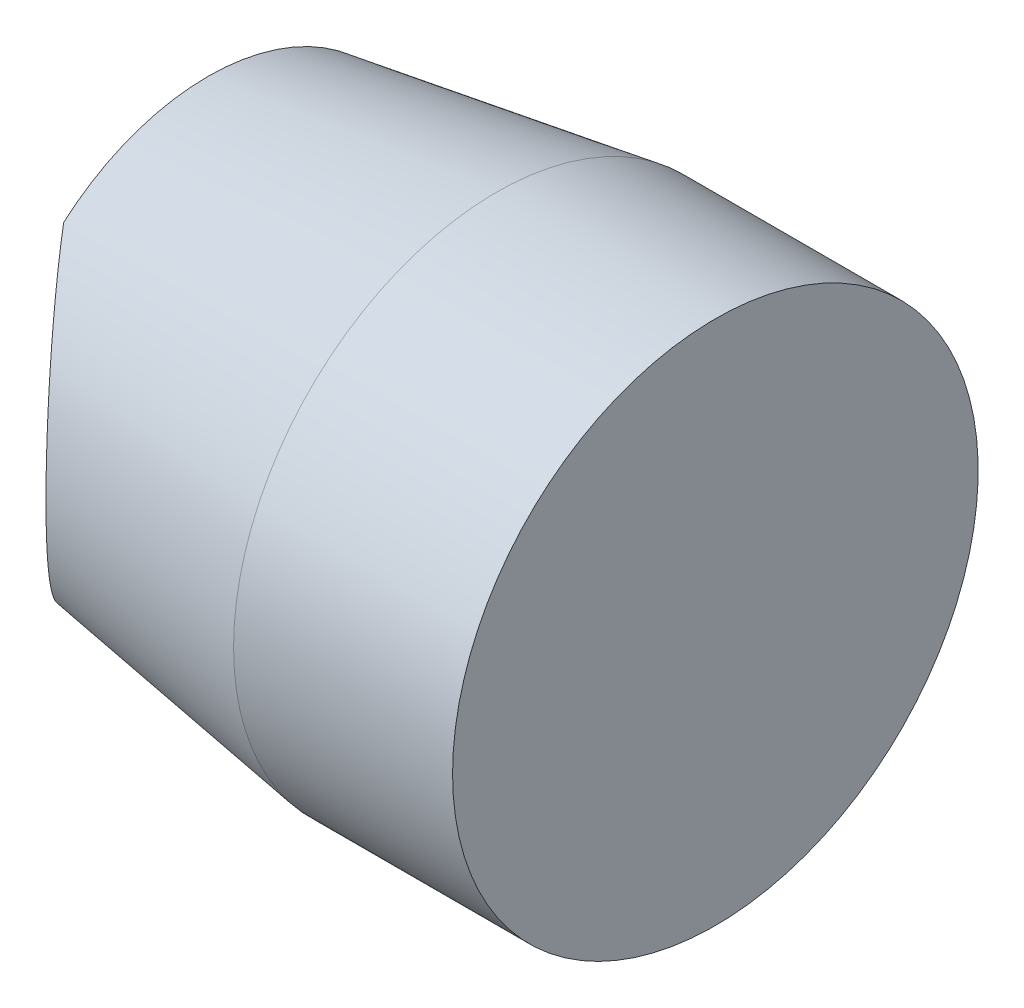
ISO-10303-21;
HEADER;
FILE_DESCRIPTION(('STEP AP214'),'2;1');
FILE_NAME('part.step','',(''),(''),'','','');
FILE_SCHEMA(('AUTOMOTIVE_DESIGN { 1 0 10303 214 1 1 1 1 }'));
ENDSEC;
DATA;
#1=APPLICATION_CONTEXT('core data for automotive mechanical design processes');
#2=APPLICATION_PROTOCOL_DEFINITION('international standard','automotive_design',2000,#1);
#3=PRODUCT_CONTEXT('',#1,'mechanical');
#4=PRODUCT('Part','Part','',(#3));
#5=PRODUCT_RELATED_PRODUCT_CATEGORY('part','',(#4));
#6=PRODUCT_DEFINITION_FORMATION('','',#4);
#7=PRODUCT_DEFINITION_CONTEXT('part definition',#1,'design');
#8=PRODUCT_DEFINITION('design','',#6,#7);
#9=PRODUCT_DEFINITION_SHAPE('','',#8);
#10=(LENGTH_UNIT() NAMED_UNIT(*) SI_UNIT(.MILLI.,.METRE.));
#11=(NAMED_UNIT(*) PLANE_ANGLE_UNIT() SI_UNIT($,.RADIAN.));
#12=(NAMED_UNIT(*) SI_UNIT($,.STERADIAN.) SOLID_ANGLE_UNIT());
#13=UNCERTAINTY_MEASURE_WITH_UNIT(LENGTH_MEASURE(1.E-05),#10,'distance_accuracy_value','');
#14=(GEOMETRIC_REPRESENTATION_CONTEXT(3) GLOBAL_UNCERTAINTY_ASSIGNED_CONTEXT((#13)) GLOBAL_UNIT_ASSIGNED_CONTEXT((#10,
#11,#12)) REPRESENTATION_CONTEXT('',''));
#15=CARTESIAN_POINT('',(0.,0.,0.));
#16=DIRECTION('',(0.,0.,1.));
#17=DIRECTION('',(1.,0.,0.));
#18=AXIS2_PLACEMENT_3D('',#15,#16,#17);
#19=CARTESIAN_POINT('',(0.,3.,0.));
#20=DIRECTION('',(1.,0.,0.));
#21=DIRECTION('',(0.,0.,-1.));
#22=AXIS2_PLACEMENT_3D('',#19,#20,#21);
#23=PLANE('',#22);
#24=CARTESIAN_POINT('',(0.,2.30271578793389,0.));
#25=CARTESIAN_POINT('',(0.,2.30271619018956,-0.256057420989866));
#26=CARTESIAN_POINT('',(0.,2.30041481848519,-0.512115486956815));
#27=CARTESIAN_POINT('',(0.,2.29111924963619,-1.02415480128034));
#28=CARTESIAN_POINT('',(0.,2.28412491334884,-1.28013604713413));
#29=CARTESIAN_POINT('',(0.,2.26515634263327,-1.79209873847997));
#30=CARTESIAN_POINT('',(0.,2.253178571374,-2.04808005473503));
#31=CARTESIAN_POINT('',(0.,2.22375143060397,-2.5597230435989));
#32=CARTESIAN_POINT('',(0.,2.20630226342632,-2.81538472767682));
#33=CARTESIAN_POINT('',(0.,2.16524643190168,-3.32543629194042));
#34=CARTESIAN_POINT('',(0.,2.14165868193388,-3.57982767413026));
#35=CARTESIAN_POINT('',(0.,2.08723238381336,-4.08783054496586));
#36=CARTESIAN_POINT('',(0.,2.05639433168584,-4.34144208576206));
#37=CARTESIAN_POINT('',(0.,1.98596835851503,-4.84715786518813));
#38=CARTESIAN_POINT('',(0.,1.94639075878595,-5.09926352451207));
#39=CARTESIAN_POINT('',(0.,1.85625347124165,-5.60147587977535));
#40=CARTESIAN_POINT('',(0.,1.80569793894974,-5.85158329507749));
#41=CARTESIAN_POINT('',(0.,1.7268048879287,-6.19068734125625));
#42=CARTESIAN_POINT('',(0.,1.70474160874452,-6.28114936187864));
#43=CARTESIAN_POINT('',(0.,1.65842518892863,-6.46151329243922));
#44=CARTESIAN_POINT('',(0.,1.63417190698073,-6.55141516583159));
#45=CARTESIAN_POINT('',(0.,1.55761053823987,-6.82052527713747));
#46=CARTESIAN_POINT('',(0.,1.50159393528638,-6.99872681524354));
#47=CARTESIAN_POINT('',(0.,1.4057193897648,-7.26818101742081));
#48=CARTESIAN_POINT('',(0.,1.37056144158468,-7.36111016036302));
#49=CARTESIAN_POINT('',(0.,1.29578812835875,-7.54514746566464));
#50=CARTESIAN_POINT('',(0.,1.25617413392555,-7.63625617786238));
#51=CARTESIAN_POINT('',(0.,1.17166272957867,-7.81562118473223));
#52=CARTESIAN_POINT('',(0.,1.12678436031493,-7.90388637202995));
#53=CARTESIAN_POINT('',(0.,1.03033462518166,-8.07664019329982));
#54=CARTESIAN_POINT('',(0.,0.978771037054321,-8.16113306485225));
#55=CARTESIAN_POINT('',(0.,0.885941912754167,-8.29664915808889));
#56=CARTESIAN_POINT('',(0.,0.84709792125466,-8.34932127970212));
#57=CARTESIAN_POINT('',(0.,0.764833982254394,-8.45113444955086));
#58=CARTESIAN_POINT('',(0.,0.721408353970244,-8.50027098403376));
#59=CARTESIAN_POINT('',(0.,0.628750007651179,-8.59375005583249));
#60=CARTESIAN_POINT('',(0.,0.57946639964579,-8.63804302692048));
#61=CARTESIAN_POINT('',(0.,0.474646326766768,-8.71854835575752));
#62=CARTESIAN_POINT('',(0.,0.419126230673049,-8.75478115605383));
#63=CARTESIAN_POINT('',(0.,0.321574321522042,-8.80503790469086));
#64=CARTESIAN_POINT('',(0.,0.281295684209852,-8.82243192409152));
#65=CARTESIAN_POINT('',(0.,0.198469720279116,-8.85055246719884));
#66=CARTESIAN_POINT('',(0.,0.155925377250438,-8.86128753498317));
#67=CARTESIAN_POINT('',(0.,0.0692672934627121,-8.8750354301983));
#68=CARTESIAN_POINT('',(0.,0.025144684355504,-8.87799394040268));
#69=CARTESIAN_POINT('',(0.,-0.0628867030327287,-8.8756600309061));
#70=CARTESIAN_POINT('',(0.,-0.106795434737063,-8.8703658880979));
#71=CARTESIAN_POINT('',(0.,-0.189453872023171,-8.85291423995703));
#72=CARTESIAN_POINT('',(0.,-0.228333011571382,-8.84134882624701));
#73=CARTESIAN_POINT('',(0.,-0.304013576985636,-8.81278219020494));
#74=CARTESIAN_POINT('',(0.,-0.340814064186539,-8.79577853483315));
#75=CARTESIAN_POINT('',(0.,-0.435724052160858,-8.74463976172805));
#76=CARTESIAN_POINT('',(0.,-0.49173488368535,-8.70663068469886));
#77=CARTESIAN_POINT('',(0.,-0.597384420222757,-8.62258351253169));
#78=CARTESIAN_POINT('',(0.,-0.647000923525924,-8.57651868587694));
#79=CARTESIAN_POINT('',(0.,-0.738420787686659,-8.48141943838558));
#80=CARTESIAN_POINT('',(0.,-0.780483190798535,-8.43262968793735));
#81=CARTESIAN_POINT('',(0.,-0.860363663787594,-8.33166006153359));
#82=CARTESIAN_POINT('',(0.,-0.898177557763886,-8.27947692834547));
#83=CARTESIAN_POINT('',(0.,-0.970265298966888,-8.1726008019032));
#84=CARTESIAN_POINT('',(0.,-1.00453235369548,-8.11790327231091));
#85=CARTESIAN_POINT('',(0.,-1.06997588681387,-8.0067365508432));
#86=CARTESIAN_POINT('',(0.,-1.1011536514987,-7.9502681093297));
#87=CARTESIAN_POINT('',(0.,-1.17871942577881,-7.80183009848809));
#88=CARTESIAN_POINT('',(0.,-1.22307166246294,-7.70879838397381));
#89=CARTESIAN_POINT('',(0.,-1.30642615604186,-7.52034871378631));
#90=CARTESIAN_POINT('',(0.,-1.3454254822028,-7.42492948447364));
#91=CARTESIAN_POINT('',(0.,-1.41906850582677,-7.23223917262614));
#92=CARTESIAN_POINT('',(0.,-1.45370425192824,-7.13496507099022));
#93=CARTESIAN_POINT('',(0.,-1.51924640991826,-6.93916248548734));
#94=CARTESIAN_POINT('',(0.,-1.55015216135109,-6.84063378287749));
#95=CARTESIAN_POINT('',(0.,-1.63845867239388,-6.54247188284159));
#96=CARTESIAN_POINT('',(0.,-1.69103038798245,-6.341401393893));
#97=CARTESIAN_POINT('',(0.,-1.76252778911013,-6.03826032449602));
#98=CARTESIAN_POINT('',(0.,-1.78512288550943,-5.93701496005578));
#99=CARTESIAN_POINT('',(0.,-1.82813198605774,-5.73406043139156));
#100=CARTESIAN_POINT('',(0.,-1.84854603196845,-5.63235127608693));
#101=CARTESIAN_POINT('',(0.,-1.9068058463016,-5.32703299721612));
#102=CARTESIAN_POINT('',(0.,-1.94175302379137,-5.12286990941627));
#103=CARTESIAN_POINT('',(0.,-2.00530126064684,-4.71354875654689));
#104=CARTESIAN_POINT('',(0.,-2.03390144215257,-4.50839055784738));
#105=CARTESIAN_POINT('',(0.,-2.08575961890146,-4.09729416459807));
#106=CARTESIAN_POINT('',(0.,-2.1090147538267,-3.89135561209155));
#107=CARTESIAN_POINT('',(0.,-2.15089621228305,-3.47902015363704));
#108=CARTESIAN_POINT('',(0.,-2.16952264070898,-3.27262325818288));
#109=CARTESIAN_POINT('',(0.,-2.21940195439557,-2.65200420600774));
#110=CARTESIAN_POINT('',(0.,-2.24454294069056,-2.23728632251772));
#111=CARTESIAN_POINT('',(0.,-2.28142740306044,-1.40725400885803));
#112=CARTESIAN_POINT('',(0.,-2.29316981067247,-0.991939533757277));
#113=CARTESIAN_POINT('',(0.,-2.3016197372805,-0.369267348183715));
#114=CARTESIAN_POINT('',(0.,-2.30291230270835,-0.16196276239538));
#115=CARTESIAN_POINT('',(0.,-2.3024710305298,0.252629882313115));
#116=CARTESIAN_POINT('',(0.,-2.30073738720339,0.459917941439896));
#117=CARTESIAN_POINT('',(0.,-2.29095752287499,1.08179520044146));
#118=CARTESIAN_POINT('',(0.,-2.27833132736208,1.49632166318861));
#119=CARTESIAN_POINT('',(0.,-2.23960090872179,2.32445014572915));
#120=CARTESIAN_POINT('',(0.,-2.21350733620163,2.73805263702833));
#121=CARTESIAN_POINT('',(0.,-2.16202951844811,3.35737616867643));
#122=CARTESIAN_POINT('',(0.,-2.14281682382819,3.56361444597708));
#123=CARTESIAN_POINT('',(0.,-2.09968033832001,3.97559397609276));
#124=CARTESIAN_POINT('',(0.,-2.07575679467123,4.1813352544184));
#125=CARTESIAN_POINT('',(0.,-2.02276922950357,4.58954739533259));
#126=CARTESIAN_POINT('',(0.,-1.99377317972838,4.79202699831362));
#127=CARTESIAN_POINT('',(0.,-1.92943633981791,5.19602664483702));
#128=CARTESIAN_POINT('',(0.,-1.89409445611595,5.39754651683657));
#129=CARTESIAN_POINT('',(0.,-1.81574891109572,5.79876514286587));
#130=CARTESIAN_POINT('',(0.,-1.77275781204449,5.99846632685503));
#131=CARTESIAN_POINT('',(0.,-1.67713009184717,6.39551924105181));
#132=CARTESIAN_POINT('',(0.,-1.62449797852452,6.59287202355924));
#133=CARTESIAN_POINT('',(0.,-1.54492452873739,6.85656335344364));
#134=CARTESIAN_POINT('',(0.,-1.52355197367489,6.92458932954281));
#135=CARTESIAN_POINT('',(0.,-1.47906175081979,7.06007099641875));
#136=CARTESIAN_POINT('',(0.,-1.45594394655084,7.12752664213677));
#137=CARTESIAN_POINT('',(0.,-1.38353872556474,7.32925136467965));
#138=CARTESIAN_POINT('',(0.,-1.33130965598138,7.46250472075917));
#139=CARTESIAN_POINT('',(0.,-1.24198272845094,7.66674464493482));
#140=CARTESIAN_POINT('',(0.,-1.20837736216438,7.73926169412236));
#141=CARTESIAN_POINT('',(0.,-1.13740084310569,7.88241962709404));
#142=CARTESIAN_POINT('',(0.,-1.10003098285226,7.95306114437709));
#143=CARTESIAN_POINT('',(0.,-1.02090992465701,8.09151760217561));
#144=CARTESIAN_POINT('',(0.,-0.979175730560581,8.15934217275296));
#145=CARTESIAN_POINT('',(0.,-0.890251463452173,8.29127566708565));
#146=CARTESIAN_POINT('',(0.,-0.843068018245905,8.35538896515575));
#147=CARTESIAN_POINT('',(0.,-0.755045799269324,8.46215935104652));
#148=CARTESIAN_POINT('',(0.,-0.715737177571885,8.50606740884148));
#149=CARTESIAN_POINT('',(0.,-0.632704545578179,8.58968335996891));
#150=CARTESIAN_POINT('',(0.,-0.588974950121212,8.62938580728426));
#151=CARTESIAN_POINT('',(0.,-0.495998697363988,8.70312099761332));
#152=CARTESIAN_POINT('',(0.,-0.446691541306113,8.73707910899359));
#153=CARTESIAN_POINT('',(0.,-0.342876817664349,8.79581530258852));
#154=CARTESIAN_POINT('',(0.,-0.288386761369271,8.82062300584898));
#155=CARTESIAN_POINT('',(0.,-0.192503788108303,8.85208446454662));
#156=CARTESIAN_POINT('',(0.,-0.152176340718685,8.86196610505212));
#157=CARTESIAN_POINT('',(0.,-0.0704317051299258,8.87476414709608));
#158=CARTESIAN_POINT('',(0.,-0.0290155178170578,8.87768673432845));
#159=CARTESIAN_POINT('',(0.,0.0537229626135532,8.87625323091297));
#160=CARTESIAN_POINT('',(0.,0.0950451431318834,8.87189082477117));
#161=CARTESIAN_POINT('',(0.,0.17638670554275,8.85634801479037));
#162=CARTESIAN_POINT('',(0.,0.216404816540665,8.84516115779466));
#163=CARTESIAN_POINT('',(0.,0.30689333045181,8.81241333859658));
#164=CARTESIAN_POINT('',(0.,0.356565965688615,8.78866889766332));
#165=CARTESIAN_POINT('',(0.,0.451507184584574,8.73362017494527));
#166=CARTESIAN_POINT('',(0.,0.496765469772759,8.70229878174129));
#167=CARTESIAN_POINT('',(0.,0.612713048969769,8.61090392671316));
#168=CARTESIAN_POINT('',(0.,0.679454832489103,8.54588313607115));
#169=CARTESIAN_POINT('',(0.,0.803085416460741,8.40717256810155));
#170=CARTESIAN_POINT('',(0.,0.859945900699665,8.33345886126733));
#171=CARTESIAN_POINT('',(0.,0.98631503516413,8.15146856801582));
#172=CARTESIAN_POINT('',(0.,1.0523081650411,8.04078083721444));
#173=CARTESIAN_POINT('',(0.,1.17368742348289,7.81365213824607));
#174=CARTESIAN_POINT('',(0.,1.22905109381456,7.69719962865867));
#175=CARTESIAN_POINT('',(0.,1.33189585938514,7.46015331640255));
#176=CARTESIAN_POINT('',(0.,1.37933253052256,7.3395404637223));
#177=CARTESIAN_POINT('',(0.,1.46764168179653,7.09611113719619));
#178=CARTESIAN_POINT('',(0.,1.50852068731415,6.97329699084475));
#179=CARTESIAN_POINT('',(0.,1.61487822130925,6.62957748985516));
#180=CARTESIAN_POINT('',(0.,1.67465938159899,6.40691503845951));
#181=CARTESIAN_POINT('',(0.,1.78206037868896,5.95863520057769));
#182=CARTESIAN_POINT('',(0.,1.82967262547771,5.73301606171055));
#183=CARTESIAN_POINT('',(0.,1.9154973103287,5.27952684179919));
#184=CARTESIAN_POINT('',(0.,1.95368975838205,5.0516530232704));
#185=CARTESIAN_POINT('',(0.,2.02240235756378,4.59474688328533));
#186=CARTESIAN_POINT('',(0.,2.05292167010774,4.3657144379925));
#187=CARTESIAN_POINT('',(0.,2.10755735583778,3.90705654637218));
#188=CARTESIAN_POINT('',(0.,2.13167812178194,3.67743161672352));
#189=CARTESIAN_POINT('',(0.,2.17447442712944,3.21766783595543));
#190=CARTESIAN_POINT('',(0.,2.19314964706602,2.98752895548248));
#191=CARTESIAN_POINT('',(0.,2.22570457347171,2.52718464100216));
#192=CARTESIAN_POINT('',(0.,2.23958982124239,2.29697959433125));
#193=CARTESIAN_POINT('',(0.,2.26306850731441,1.83635170891861));
#194=CARTESIAN_POINT('',(0.,2.27266191776965,1.60592886877352));
#195=CARTESIAN_POINT('',(0.,2.28782899789987,1.14629951757147));
#196=CARTESIAN_POINT('',(0.,2.29342581672636,0.917093762259857));
#197=CARTESIAN_POINT('',(0.,2.30086927779234,0.458592182283086));
#198=CARTESIAN_POINT('',(0.,2.30271542771876,0.229296349744708));
#199=CARTESIAN_POINT('',(0.,2.30271578793389,0.));
#200=B_SPLINE_CURVE_WITH_KNOTS('',3,(#24,#25,#26,#27,#28,#29,#30,#31,#32,#33,#34,#35,#36,#37,
#38,#39,#40,#41,#42,#43,#44,#45,#46,#47,#48,#49,#50,#51,#52,#53,#54,#55,#56,#57,#58,#59,#60,#61,
#62,#63,#64,#65,#66,#67,#68,#69,#70,#71,#72,#73,#74,#75,#76,#77,#78,#79,#80,#81,#82,#83,#84,#85,
#86,#87,#88,#89,#90,#91,#92,#93,#94,#95,#96,#97,#98,#99,#100,#101,#102,#103,#104,#105,#106,#107,
#108,#109,#110,#111,#112,#113,#114,#115,#116,#117,#118,#119,#120,#121,#122,#123,#124,#125,#126,
#127,#128,#129,#130,#131,#132,#133,#134,#135,#136,#137,#138,#139,#140,#141,#142,#143,#144,#145,
#146,#147,#148,#149,#150,#151,#152,#153,#154,#155,#156,#157,#158,#159,#160,#161,#162,#163,#164,
#165,#166,#167,#168,#169,#170,#171,#172,#173,#174,#175,#176,#177,#178,#179,#180,#181,#182,#183,
#184,#185,#186,#187,#188,#189,#190,#191,#192,#193,#194,#195,#196,#197,#198,#199),.UNSPECIFIED.,
.T.,.F.,(4,2,2,2,2,2,2,2,2,2,2,2,2,2,2,2,2,2,2,2,2,2,2,2,2,2,2,2,2,2,2,2,2,2,2,2,2,2,2,2,2,2,2,
2,2,2,2,2,2,2,2,2,2,2,2,2,2,2,2,2,2,2,2,2,2,2,2,2,2,2,2,2,2,2,2,2,2,2,2,2,2,2,2,2,2,2,2,4),(0.,
0.768162777638334,1.53634833170923,2.30508001304346,3.07378326990723,3.84014545581212,
4.60645522674255,5.37186478846892,6.13698511997906,6.4163009921842,6.69563490094226,
7.25556624394516,7.55355368307463,7.8514497151043,8.14829971355869,8.44480739786877,
8.64095731216252,8.83735335688242,9.03560105147041,9.23334005928364,9.36449587532189,
9.49548305578821,9.62738274585719,9.75930997952392,9.88052677215571,10.0017978725623,
10.2036926061374,10.4062704626149,10.599234673315,10.792386921108,10.985902481908,
11.1793371265712,11.4882896127895,11.7974105823384,12.1070869294942,12.4168180296452,
13.039911535577,13.3511073739033,13.6622972525352,14.2835598033516,14.904908228193,
15.5265883877439,16.1482544576183,17.3944024325485,18.6406497739719,19.2625564398833,
19.8844231813889,21.1283840527891,22.3713626480266,22.9927138206122,23.6140323915134,
24.2275868929556,24.8412472288481,25.4539089026205,26.066284843631,26.2801765866915,
26.4940850731836,26.9230689947348,27.162762966432,27.4023749191951,27.6410858438768,
27.8795094281005,28.0560719580124,28.2328604006605,28.411793724899,28.5901426270652,
28.7141734861787,28.8380940567559,28.9621221121203,29.0862676297962,29.2505025419247,
29.4151118747224,29.6930675532079,29.9718070678961,30.3574746211609,30.743948266951,
31.1325199784088,31.5207025999954,32.2118084223996,32.9033442560854,33.5963352281616,
34.2894019031967,34.9819915324139,35.6746217847144,36.3664480560729,37.0582788160413,
37.7460690977029,38.4339496529366),.UNSPECIFIED.);
#201=CARTESIAN_POINT('',(-1.1433992165525E-11,-2.25575357307668,-1.97777041578171));
#202=VERTEX_POINT('',#201);
#203=CARTESIAN_POINT('',(0.,-2.25575357306466,1.97777041581523));
#204=VERTEX_POINT('',#203);
#205=EDGE_CURVE('E65',#202,#204,#200,.T.);
#206=ORIENTED_EDGE('',*,*,#205,.F.);
#207=CARTESIAN_POINT('',(0.,0.,0.));
#208=DIRECTION('',(-1.,0.,0.));
#209=DIRECTION('',(0.,0.,1.));
#210=AXIS2_PLACEMENT_3D('',#207,#208,#209);
#211=CIRCLE('',#210,3.);
#212=EDGE_CURVE('E79',#202,#204,#211,.T.);
#213=ORIENTED_EDGE('',*,*,#212,.T.);
#214=EDGE_LOOP('',(#206,#213));
#215=FACE_BOUND('',#214,.T.);
#216=ADVANCED_FACE('F39',(#215),#23,.F.);
#217=CARTESIAN_POINT('',(0.,2.25575357306555,1.97777041579692));
#218=VERTEX_POINT('',#217);
#219=CARTESIAN_POINT('',(0.,2.25575357306554,-1.97777041579706));
#220=VERTEX_POINT('',#219);
#221=EDGE_CURVE('E60',#218,#220,#200,.T.);
#222=ORIENTED_EDGE('',*,*,#221,.F.);
#223=EDGE_CURVE('E84',#218,#220,#211,.T.);
#224=ORIENTED_EDGE('',*,*,#223,.T.);
#225=EDGE_LOOP('',(#222,#224));
#226=FACE_BOUND('',#225,.T.);
#227=ADVANCED_FACE('F114',(#226),#23,.F.);
#228=CARTESIAN_POINT('',(3.95,0.,0.));
#229=DIRECTION('',(1.,0.,0.));
#230=DIRECTION('',(0.,0.,-1.));
#231=AXIS2_PLACEMENT_3D('',#228,#229,#230);
#232=CONICAL_SURFACE('',#231,3.6,0.150746381120422);
#233=CARTESIAN_POINT('',(3.95,0.,0.));
#234=DIRECTION('',(-1.,0.,0.));
#235=DIRECTION('',(0.,0.,1.));
#236=AXIS2_PLACEMENT_3D('',#233,#234,#235);
#237=CIRCLE('',#236,3.6);
#238=CARTESIAN_POINT('',(3.95,0.,3.6));
#239=VERTEX_POINT('',#238);
#240=EDGE_CURVE('E87',#239,#239,#237,.T.);
#241=ORIENTED_EDGE('',*,*,#240,.T.);
#242=EDGE_LOOP('',(#241));
#243=FACE_BOUND('',#242,.T.);
#244=CARTESIAN_POINT('',(-0.545610889147609,-2.67057044931373,1.17373615089215));
#245=CARTESIAN_POINT('',(-0.502803108813773,-2.64569966593585,1.24641302995476));
#246=CARTESIAN_POINT('',(-0.458722948137358,-2.61850442403317,1.31751277000916));
#247=CARTESIAN_POINT('',(-0.369035883915507,-2.55938889644057,1.45672657748777));
#248=CARTESIAN_POINT('',(-0.323428976447891,-2.52746859861136,1.5248406372408));
#249=CARTESIAN_POINT('',(-0.231357229603584,-2.45856545329473,1.65875957653372));
#250=CARTESIAN_POINT('',(-0.184888501011268,-2.42154588507832,1.7245429069225));
#251=CARTESIAN_POINT('',(-0.0921990777257676,-2.34252543320335,1.85321127113476));
#252=CARTESIAN_POINT('',(-0.0459783917505551,-2.30052437564308,1.91609620366992));
#253=CARTESIAN_POINT('',(0.0958622044928516,-2.16240915564013,2.10635757089889));
#254=CARTESIAN_POINT('',(0.18997682899668,-2.05753139173722,2.22870056617786));
#255=CARTESIAN_POINT('',(0.368249884253227,-1.82448165870408,2.45688291391883));
#256=CARTESIAN_POINT('',(0.452437517429607,-1.69638097696711,2.56277097994706));
#257=CARTESIAN_POINT('',(0.587156270548502,-1.44998452044558,2.73079615572037));
#258=CARTESIAN_POINT('',(0.640942468029903,-1.33650067704264,2.7973620293662));
#259=CARTESIAN_POINT('',(0.736503908371695,-1.0969413283267,2.91516163052352));
#260=CARTESIAN_POINT('',(0.778282591632269,-0.970869443724066,2.96639974992455));
#261=CARTESIAN_POINT('',(0.829876786481205,-0.77390830255137,3.02954303670104));
#262=CARTESIAN_POINT('',(0.845275542620623,-0.706607024436623,3.04836132989053));
#263=CARTESIAN_POINT('',(0.871963837686773,-0.570010271370193,3.0809491564713));
#264=CARTESIAN_POINT('',(0.883255489939714,-0.500715841866394,3.09472128641232));
#265=CARTESIAN_POINT('',(0.901469446075214,-0.360737087188058,3.11692601434145));
#266=CARTESIAN_POINT('',(0.908393685901765,-0.290053392181442,3.12536097814178));
#267=CARTESIAN_POINT('',(0.917722093815138,-0.147973788290901,3.13672258482315));
#268=CARTESIAN_POINT('',(0.920126891824431,-0.0765779800565048,3.13964999535028));
#269=CARTESIAN_POINT('',(0.920413007689851,0.118599076630239,3.1399992014675));
#270=CARTESIAN_POINT('',(0.913694776379617,0.242472090451541,3.13182253747278));
#271=CARTESIAN_POINT('',(0.886924348076632,0.486454040652434,3.09919796974569));
#272=CARTESIAN_POINT('',(0.866873962858767,0.606563486160643,3.07475227689483));
#273=CARTESIAN_POINT('',(0.81520373752643,0.838288434684297,3.01160581410382));
#274=CARTESIAN_POINT('',(0.783761141518193,0.950003996543325,2.97312337425642));
#275=CARTESIAN_POINT('',(0.711011975573178,1.16495478006154,2.88376596576031));
#276=CARTESIAN_POINT('',(0.669696355563081,1.26818210363047,2.83287962625677));
#277=CARTESIAN_POINT('',(0.560071273732403,1.50623977849673,2.69715846501101));
#278=CARTESIAN_POINT('',(0.487705130998386,1.63618675154774,2.60703325881913));
#279=CARTESIAN_POINT('',(0.332049566542625,1.87545195765728,2.4107486343961));
#280=CARTESIAN_POINT('',(0.248761609071415,1.98477295118781,2.30459136524023));
#281=CARTESIAN_POINT('',(0.135812001257767,2.11452034244966,2.15757222126995));
#282=CARTESIAN_POINT('',(0.108925094597979,2.14411136176039,2.12236154811415));
#283=CARTESIAN_POINT('',(0.0546816329969175,2.20142511376235,2.05078477370333));
#284=CARTESIAN_POINT('',(0.0273250443679917,2.22914771173386,2.01441858940951));
#285=CARTESIAN_POINT('',(-0.0573639719746663,2.31160782020116,1.90083421547522));
#286=CARTESIAN_POINT('',(-0.115254509080531,2.36329073265159,1.82179305848447));
#287=CARTESIAN_POINT('',(-0.231197403932565,2.45895944738774,1.65917884427957));
#288=CARTESIAN_POINT('',(-0.289249864242285,2.50293772432165,1.57560145958115));
#289=CARTESIAN_POINT('',(-0.403767855186071,2.58330559544734,1.40399384530779));
#290=CARTESIAN_POINT('',(-0.460235146492306,2.61970392276178,1.31596888693304));
#291=CARTESIAN_POINT('',(-0.569345218412312,2.68505262421899,1.1350131547946));
#292=CARTESIAN_POINT('',(-0.621992734949701,2.71401233835736,1.04208871142006));
#293=CARTESIAN_POINT('',(-0.697864147994482,2.75304572872195,0.893797514835816));
#294=CARTESIAN_POINT('',(-0.723635820828495,2.76574107371353,0.84042827566491));
#295=CARTESIAN_POINT('',(-0.772121696912091,2.78881611331405,0.731854105530617));
#296=CARTESIAN_POINT('',(-0.794836468116664,2.79919623831398,0.676649517947995));
#297=CARTESIAN_POINT('',(-0.815593957363158,2.80838992900986,0.620457917948785));
#298=B_SPLINE_CURVE_WITH_KNOTS('',3,(#244,#245,#246,#247,#248,#249,#250,#251,#252,#253,#254,
#255,#256,#257,#258,#259,#260,#261,#262,#263,#264,#265,#266,#267,#268,#269,#270,#271,#272,#273,
#274,#275,#276,#277,#278,#279,#280,#281,#282,#283,#284,#285,#286,#287,#288,#289,#290,#291,#292,
#293,#294,#295,#296,#297),.UNSPECIFIED.,.F.,.F.,(4,2,2,2,2,2,2,2,2,2,2,2,2,2,2,2,2,2,2,2,2,2,2,
2,2,2,4),(0.,0.26371972289796,0.527440123338272,0.793169931087007,1.05890901808333,
1.61654072030406,2.17248878573669,2.59732979246079,3.02204895185715,3.23645519886422,
3.45075096571203,3.66495167474106,3.87912252613384,4.25006146739332,4.62095001015392,
4.98629988195101,5.35198594382299,5.87091014854623,6.38976485385845,6.54956752645344,
6.70938170908067,7.04128357033203,7.37350782445372,7.70534716758138,8.036767790435,
8.21846657407667,8.40013155237051),.UNSPECIFIED.);
#299=EDGE_CURVE('E11',#204,#218,#298,.T.);
#300=ORIENTED_EDGE('',*,*,#299,.F.);
#301=ORIENTED_EDGE('',*,*,#212,.F.);
#302=CARTESIAN_POINT('',(-0.545610889147609,2.67057044931373,-1.17373615089215));
#303=CARTESIAN_POINT('',(-0.502803108813775,2.64569966593585,-1.24641302995476));
#304=CARTESIAN_POINT('',(-0.45872294813736,2.61850442403317,-1.31751277000916));
#305=CARTESIAN_POINT('',(-0.369035883915509,2.55938889644056,-1.45672657748777));
#306=CARTESIAN_POINT('',(-0.323428976447891,2.52746859861136,-1.5248406372408));
#307=CARTESIAN_POINT('',(-0.23135722960358,2.45856545329472,-1.65875957653372));
#308=CARTESIAN_POINT('',(-0.184888501011263,2.42154588507832,-1.7245429069225));
#309=CARTESIAN_POINT('',(-0.0921990777257619,2.34252543320334,-1.85321127113476));
#310=CARTESIAN_POINT('',(-0.0459783917505506,2.30052437564307,-1.91609620366993));
#311=CARTESIAN_POINT('',(0.0958622044928544,2.16240915564012,-2.10635757089889));
#312=CARTESIAN_POINT('',(0.189976828996686,2.05753139173722,-2.22870056617786));
#313=CARTESIAN_POINT('',(0.368249884253233,1.82448165870408,-2.45688291391883));
#314=CARTESIAN_POINT('',(0.452437517429609,1.6963809769671,-2.56277097994707));
#315=CARTESIAN_POINT('',(0.5871562705485,1.44998452044557,-2.73079615572038));
#316=CARTESIAN_POINT('',(0.6409424680299,1.33650067704263,-2.79736202936621));
#317=CARTESIAN_POINT('',(0.736503908371696,1.0969413283267,-2.91516163052352));
#318=CARTESIAN_POINT('',(0.778282591632273,0.970869443724063,-2.96639974992455));
#319=CARTESIAN_POINT('',(0.829876786481207,0.773908302551366,-3.02954303670104));
#320=CARTESIAN_POINT('',(0.845275542620623,0.70660702443662,-3.04836132989053));
#321=CARTESIAN_POINT('',(0.871963837686769,0.570010271370189,-3.0809491564713));
#322=CARTESIAN_POINT('',(0.883255489939709,0.500715841866389,-3.09472128641232));
#323=CARTESIAN_POINT('',(0.901469446075216,0.360737087188054,-3.11692601434145));
#324=CARTESIAN_POINT('',(0.908393685901775,0.290053392181438,-3.12536097814178));
#325=CARTESIAN_POINT('',(0.917722093815146,0.147973788290897,-3.13672258482316));
#326=CARTESIAN_POINT('',(0.92012689182443,0.0765779800565002,-3.13964999535028));
#327=CARTESIAN_POINT('',(0.920413007689837,-0.118599076630244,-3.1399992014675));
#328=CARTESIAN_POINT('',(0.913694776379611,-0.242472090451546,-3.13182253747278));
#329=CARTESIAN_POINT('',(0.886924348076634,-0.486454040652438,-3.09919796974569));
#330=CARTESIAN_POINT('',(0.866873962858771,-0.606563486160648,-3.07475227689483));
#331=CARTESIAN_POINT('',(0.815203737526433,-0.838288434684301,-3.01160581410382));
#332=CARTESIAN_POINT('',(0.783761141518195,-0.950003996543328,-2.97312337425642));
#333=CARTESIAN_POINT('',(0.711011975573178,-1.16495478006155,-2.8837659657603));
#334=CARTESIAN_POINT('',(0.669696355563079,-1.26818210363047,-2.83287962625677));
#335=CARTESIAN_POINT('',(0.560071273732401,-1.50623977849673,-2.697158465011));
#336=CARTESIAN_POINT('',(0.487705130998386,-1.63618675154774,-2.60703325881912));
#337=CARTESIAN_POINT('',(0.332049566542626,-1.87545195765729,-2.4107486343961));
#338=CARTESIAN_POINT('',(0.248761609071412,-1.98477295118781,-2.30459136524023));
#339=CARTESIAN_POINT('',(0.135812001257767,-2.11452034244966,-2.15757222126995));
#340=CARTESIAN_POINT('',(0.108925094597981,-2.14411136176039,-2.12236154811415));
#341=CARTESIAN_POINT('',(0.0546816329969211,-2.20142511376235,-2.05078477370334));
#342=CARTESIAN_POINT('',(0.0273250443679953,-2.22914771173386,-2.01441858940952));
#343=CARTESIAN_POINT('',(-0.0573639719746627,-2.31160782020116,-1.90083421547522));
#344=CARTESIAN_POINT('',(-0.115254509080526,-2.36329073265159,-1.82179305848448));
#345=CARTESIAN_POINT('',(-0.231197403932559,-2.45895944738773,-1.65917884427958));
#346=CARTESIAN_POINT('',(-0.289249864242282,-2.50293772432165,-1.57560145958116));
#347=CARTESIAN_POINT('',(-0.403767855186068,-2.58330559544734,-1.4039938453078));
#348=CARTESIAN_POINT('',(-0.4602351464923,-2.61970392276178,-1.31596888693305));
#349=CARTESIAN_POINT('',(-0.569345218412308,-2.68505262421898,-1.13501315479461));
#350=CARTESIAN_POINT('',(-0.621992734949702,-2.71401233835736,-1.04208871142007));
#351=CARTESIAN_POINT('',(-0.697864147994482,-2.75304572872195,-0.893797514835823));
#352=CARTESIAN_POINT('',(-0.723635820828494,-2.76574107371353,-0.840428275664915));
#353=CARTESIAN_POINT('',(-0.772121696912088,-2.78881611331405,-0.731854105530619));
#354=CARTESIAN_POINT('',(-0.794836468116661,-2.79919623831398,-0.676649517947996));
#355=CARTESIAN_POINT('',(-0.815593957363158,-2.80838992900986,-0.620457917948785));
#356=B_SPLINE_CURVE_WITH_KNOTS('',3,(#302,#303,#304,#305,#306,#307,#308,#309,#310,#311,#312,
#313,#314,#315,#316,#317,#318,#319,#320,#321,#322,#323,#324,#325,#326,#327,#328,#329,#330,#331,
#332,#333,#334,#335,#336,#337,#338,#339,#340,#341,#342,#343,#344,#345,#346,#347,#348,#349,#350,
#351,#352,#353,#354,#355),.UNSPECIFIED.,.F.,.F.,(4,2,2,2,2,2,2,2,2,2,2,2,2,2,2,2,2,2,2,2,2,2,2,
2,2,2,4),(0.,0.263719722897962,0.527440123338277,0.793169931087013,1.05890901808334,
1.61654072030406,2.1724887857367,2.5973297924608,3.02204895185716,3.23645519886422,
3.45075096571203,3.66495167474106,3.87912252613385,4.25006146739333,4.62095001015392,
4.98629988195101,5.351985943823,5.87091014854624,6.38976485385846,6.54956752645344,
6.70938170908066,7.04128357033203,7.37350782445372,7.70534716758138,8.03676779043499,
8.21846657407667,8.40013155237052),.UNSPECIFIED.);
#357=EDGE_CURVE('E54',#220,#202,#356,.T.);
#358=ORIENTED_EDGE('',*,*,#357,.F.);
#359=ORIENTED_EDGE('',*,*,#223,.F.);
#360=EDGE_LOOP('',(#300,#301,#358,#359));
#361=FACE_BOUND('',#360,.T.);
#362=ADVANCED_FACE('F82',(#243,#361),#232,.T.);
#363=CARTESIAN_POINT('',(6.95,0.,0.));
#364=DIRECTION('',(-1.,0.,0.));
#365=DIRECTION('',(0.,0.,1.));
#366=AXIS2_PLACEMENT_3D('',#363,#364,#365);
#367=PLANE('',#366);
#368=CARTESIAN_POINT('',(6.95,0.,0.));
#369=DIRECTION('',(-1.,0.,0.));
#370=DIRECTION('',(0.,0.,1.));
#371=AXIS2_PLACEMENT_3D('',#368,#369,#370);
#372=CIRCLE('',#371,3.6);
#373=CARTESIAN_POINT('',(6.95,0.,3.6));
#374=VERTEX_POINT('',#373);
#375=EDGE_CURVE('E76',#374,#374,#372,.T.);
#376=ORIENTED_EDGE('',*,*,#375,.F.);
#377=EDGE_LOOP('',(#376));
#378=FACE_BOUND('',#377,.T.);
#379=ADVANCED_FACE('F111',(#378),#367,.F.);
#380=CARTESIAN_POINT('',(0.,0.,0.));
#381=DIRECTION('',(-1.,0.,0.));
#382=DIRECTION('',(0.,0.,1.));
#383=AXIS2_PLACEMENT_3D('',#380,#381,#382);
#384=CYLINDRICAL_SURFACE('',#383,3.6);
#385=ORIENTED_EDGE('',*,*,#240,.F.);
#386=EDGE_LOOP('',(#385));
#387=FACE_BOUND('',#386,.T.);
#388=ORIENTED_EDGE('',*,*,#375,.T.);
#389=EDGE_LOOP('',(#388));
#390=FACE_BOUND('',#389,.T.);
#391=ADVANCED_FACE('F105',(#387,#390),#384,.T.);
#392=CARTESIAN_POINT('',(-37.,0.,0.));
#393=DIRECTION('',(0.,1.,0.));
#394=DIRECTION('',(0.,0.,1.));
#395=AXIS2_PLACEMENT_3D('',#392,#393,#394);
#396=TOROIDAL_SURFACE('',#395,35.,3.05);
#397=ORIENTED_EDGE('',*,*,#299,.T.);
#398=ORIENTED_EDGE('',*,*,#221,.T.);
#399=ORIENTED_EDGE('',*,*,#357,.T.);
#400=ORIENTED_EDGE('',*,*,#205,.T.);
#401=EDGE_LOOP('',(#397,#398,#399,#400));
#402=FACE_BOUND('',#401,.T.);
#403=ADVANCED_FACE('F70',(#402),#396,.F.);
#404=CLOSED_SHELL('',(#216,#227,#362,#379,#391,#403));
#405=MANIFOLD_SOLID_BREP('B2',#404);
#406=ADVANCED_BREP_SHAPE_REPRESENTATION('',(#18,#405),#14);
#407=SHAPE_DEFINITION_REPRESENTATION(#9,#406);
ENDSEC;
END-ISO-10303-21;
